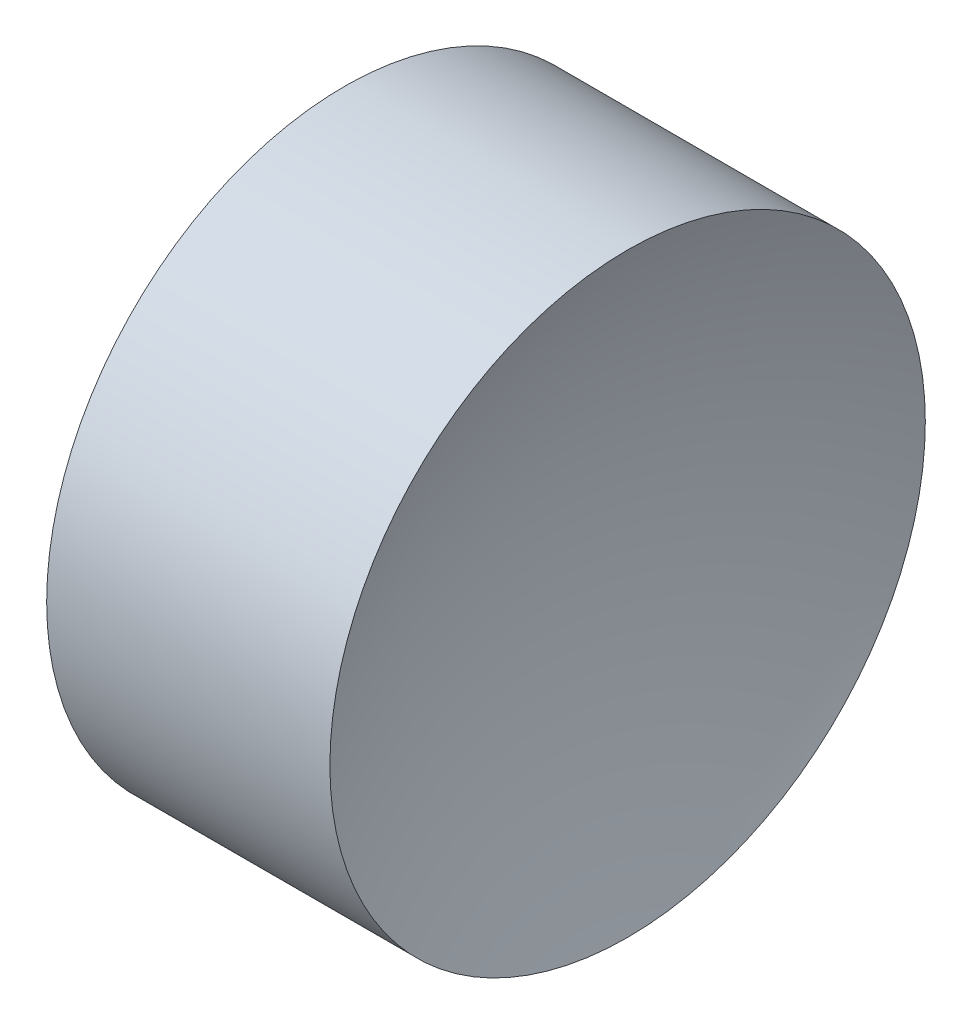
ISO-10303-21;
HEADER;
FILE_DESCRIPTION(('STEP AP214'),'2;1');
FILE_NAME('part.step','',(''),(''),'','','');
FILE_SCHEMA(('AUTOMOTIVE_DESIGN { 1 0 10303 214 1 1 1 1 }'));
ENDSEC;
DATA;
#1=APPLICATION_CONTEXT('core data for automotive mechanical design processes');
#2=APPLICATION_PROTOCOL_DEFINITION('international standard','automotive_design',2000,#1);
#3=PRODUCT_CONTEXT('',#1,'mechanical');
#4=PRODUCT('Part','Part','',(#3));
#5=PRODUCT_RELATED_PRODUCT_CATEGORY('part','',(#4));
#6=PRODUCT_DEFINITION_FORMATION('','',#4);
#7=PRODUCT_DEFINITION_CONTEXT('part definition',#1,'design');
#8=PRODUCT_DEFINITION('design','',#6,#7);
#9=PRODUCT_DEFINITION_SHAPE('','',#8);
#10=(LENGTH_UNIT() NAMED_UNIT(*) SI_UNIT(.MILLI.,.METRE.));
#11=(NAMED_UNIT(*) PLANE_ANGLE_UNIT() SI_UNIT($,.RADIAN.));
#12=(NAMED_UNIT(*) SI_UNIT($,.STERADIAN.) SOLID_ANGLE_UNIT());
#13=UNCERTAINTY_MEASURE_WITH_UNIT(LENGTH_MEASURE(1.E-05),#10,'distance_accuracy_value','');
#14=(GEOMETRIC_REPRESENTATION_CONTEXT(3) GLOBAL_UNCERTAINTY_ASSIGNED_CONTEXT((#13)) GLOBAL_UNIT_ASSIGNED_CONTEXT((#10,
#11,#12)) REPRESENTATION_CONTEXT('',''));
#15=CARTESIAN_POINT('',(0.,0.,0.));
#16=DIRECTION('',(0.,0.,1.));
#17=DIRECTION('',(1.,0.,0.));
#18=AXIS2_PLACEMENT_3D('',#15,#16,#17);
#19=CARTESIAN_POINT('',(17.8269898758655,6.51556304570152,0.));
#20=DIRECTION('',(-1.,0.,0.));
#21=DIRECTION('',(0.,-1.,0.));
#22=AXIS2_PLACEMENT_3D('',#19,#20,#21);
#23=SPHERICAL_SURFACE('',#22,5.17);
#24=CARTESIAN_POINT('',(13.0595062628889,6.51556304570152,0.));
#25=DIRECTION('',(-1.,0.,0.));
#26=DIRECTION('',(0.,0.,1.));
#27=AXIS2_PLACEMENT_3D('',#24,#25,#26);
#28=CIRCLE('',#27,2.);
#29=CARTESIAN_POINT('',(13.0595062628889,6.51556304570152,2.));
#30=VERTEX_POINT('',#29);
#31=EDGE_CURVE('E10',#30,#30,#28,.T.);
#32=ORIENTED_EDGE('',*,*,#31,.F.);
#33=EDGE_LOOP('',(#32));
#34=FACE_BOUND('',#33,.T.);
#35=ADVANCED_FACE('F35',(#34),#23,.F.);
#36=CARTESIAN_POINT('',(10.3420153175664,6.51556304570152,0.));
#37=DIRECTION('',(-1.,0.,0.));
#38=DIRECTION('',(0.,0.,1.));
#39=AXIS2_PLACEMENT_3D('',#36,#37,#38);
#40=CYLINDRICAL_SURFACE('',#39,2.);
#41=CARTESIAN_POINT('',(11.1569898758655,6.51556304570152,0.));
#42=DIRECTION('',(-1.,0.,0.));
#43=DIRECTION('',(0.,0.,1.));
#44=AXIS2_PLACEMENT_3D('',#41,#42,#43);
#45=CIRCLE('',#44,2.);
#46=CARTESIAN_POINT('',(11.1569898758655,6.51556304570152,2.));
#47=VERTEX_POINT('',#46);
#48=EDGE_CURVE('E41',#47,#47,#45,.T.);
#49=ORIENTED_EDGE('',*,*,#48,.F.);
#50=EDGE_LOOP('',(#49));
#51=FACE_BOUND('',#50,.T.);
#52=ORIENTED_EDGE('',*,*,#31,.T.);
#53=EDGE_LOOP('',(#52));
#54=FACE_BOUND('',#53,.T.);
#55=ADVANCED_FACE('F49',(#51,#54),#40,.T.);
#56=CARTESIAN_POINT('',(11.1569898758655,6.51556304570152,0.));
#57=DIRECTION('',(1.,0.,0.));
#58=DIRECTION('',(0.,0.,-1.));
#59=AXIS2_PLACEMENT_3D('',#56,#57,#58);
#60=PLANE('',#59);
#61=ORIENTED_EDGE('',*,*,#48,.T.);
#62=EDGE_LOOP('',(#61));
#63=FACE_BOUND('',#62,.T.);
#64=ADVANCED_FACE('F47',(#63),#60,.F.);
#65=CLOSED_SHELL('',(#35,#55,#64));
#66=MANIFOLD_SOLID_BREP('B2',#65);
#67=ADVANCED_BREP_SHAPE_REPRESENTATION('',(#18,#66),#14);
#68=SHAPE_DEFINITION_REPRESENTATION(#9,#67);
ENDSEC;
END-ISO-10303-21;
